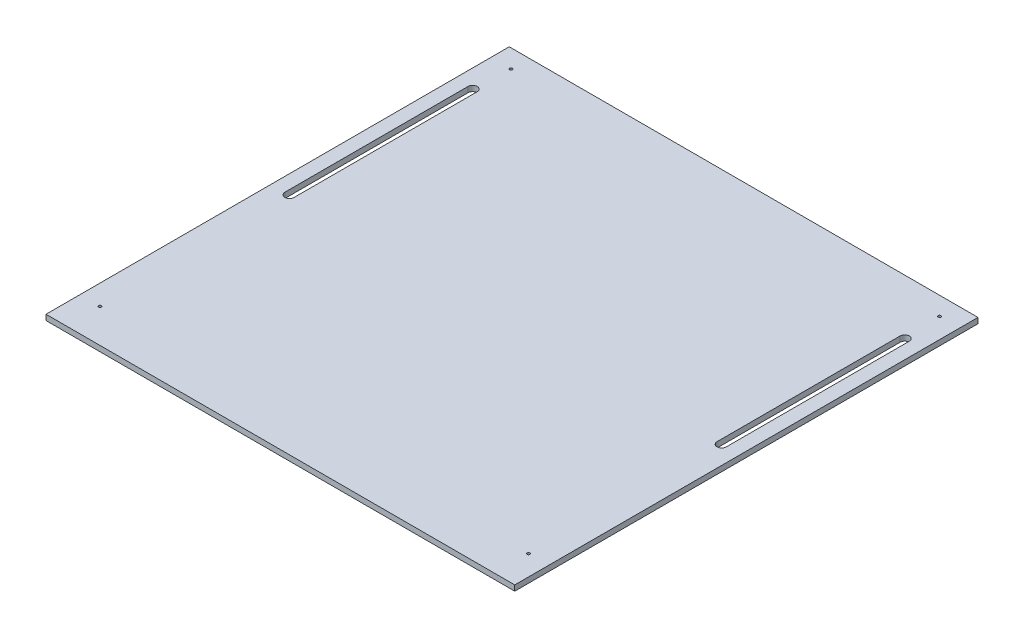
ISO-10303-21;
HEADER;
FILE_DESCRIPTION(('STEP AP214'),'2;1');
FILE_NAME('part.step','',(''),(''),'','','');
FILE_SCHEMA(('AUTOMOTIVE_DESIGN { 1 0 10303 214 1 1 1 1 }'));
ENDSEC;
DATA;
#1=APPLICATION_CONTEXT('core data for automotive mechanical design processes');
#2=APPLICATION_PROTOCOL_DEFINITION('international standard','automotive_design',2000,#1);
#3=PRODUCT_CONTEXT('',#1,'mechanical');
#4=PRODUCT('Part','Part','',(#3));
#5=PRODUCT_RELATED_PRODUCT_CATEGORY('part','',(#4));
#6=PRODUCT_DEFINITION_FORMATION('','',#4);
#7=PRODUCT_DEFINITION_CONTEXT('part definition',#1,'design');
#8=PRODUCT_DEFINITION('design','',#6,#7);
#9=PRODUCT_DEFINITION_SHAPE('','',#8);
#10=(LENGTH_UNIT() NAMED_UNIT(*) SI_UNIT(.MILLI.,.METRE.));
#11=(NAMED_UNIT(*) PLANE_ANGLE_UNIT() SI_UNIT($,.RADIAN.));
#12=(NAMED_UNIT(*) SI_UNIT($,.STERADIAN.) SOLID_ANGLE_UNIT());
#13=UNCERTAINTY_MEASURE_WITH_UNIT(LENGTH_MEASURE(1.E-05),#10,'distance_accuracy_value','');
#14=(GEOMETRIC_REPRESENTATION_CONTEXT(3) GLOBAL_UNCERTAINTY_ASSIGNED_CONTEXT((#13)) GLOBAL_UNIT_ASSIGNED_CONTEXT((#10,
#11,#12)) REPRESENTATION_CONTEXT('',''));
#15=CARTESIAN_POINT('',(0.,0.,0.));
#16=DIRECTION('',(0.,0.,1.));
#17=DIRECTION('',(1.,0.,0.));
#18=AXIS2_PLACEMENT_3D('',#15,#16,#17);
#19=CARTESIAN_POINT('',(0.,6.,0.));
#20=DIRECTION('',(0.,1.,0.));
#21=DIRECTION('',(0.,0.,1.));
#22=AXIS2_PLACEMENT_3D('',#19,#20,#21);
#23=PLANE('',#22);
#24=CARTESIAN_POINT('',(14.,6.,60.));
#25=DIRECTION('',(0.,-1.,0.));
#26=DIRECTION('',(0.,0.,-1.));
#27=AXIS2_PLACEMENT_3D('',#24,#25,#26);
#28=CIRCLE('',#27,5.);
#29=CARTESIAN_POINT('',(9.,6.,59.9999999999999));
#30=VERTEX_POINT('',#29);
#31=CARTESIAN_POINT('',(19.,6.,59.9999999999999));
#32=VERTEX_POINT('',#31);
#33=EDGE_CURVE('E134',#30,#32,#28,.T.);
#34=ORIENTED_EDGE('',*,*,#33,.T.);
#35=DIRECTION('',(0.,0.,1.));
#36=VECTOR('',#35,1.);
#37=CARTESIAN_POINT('',(19.,6.,59.9999999999999));
#38=LINE('',#37,#36);
#39=CARTESIAN_POINT('',(19.,6.,260.));
#40=VERTEX_POINT('',#39);
#41=EDGE_CURVE('E146',#32,#40,#38,.T.);
#42=ORIENTED_EDGE('',*,*,#41,.T.);
#43=CARTESIAN_POINT('',(13.9999999999993,6.,260.));
#44=DIRECTION('',(0.,-1.,0.));
#45=DIRECTION('',(0.,0.,-1.));
#46=AXIS2_PLACEMENT_3D('',#43,#44,#45);
#47=CIRCLE('',#46,5.);
#48=CARTESIAN_POINT('',(9.,6.,260.));
#49=VERTEX_POINT('',#48);
#50=EDGE_CURVE('E55',#40,#49,#47,.T.);
#51=ORIENTED_EDGE('',*,*,#50,.T.);
#52=DIRECTION('',(0.,0.,1.));
#53=VECTOR('',#52,1.);
#54=CARTESIAN_POINT('',(9.,6.,59.9999999999999));
#55=LINE('',#54,#53);
#56=EDGE_CURVE('E143',#30,#49,#55,.T.);
#57=ORIENTED_EDGE('',*,*,#56,.F.);
#58=EDGE_LOOP('',(#34,#42,#51,#57));
#59=FACE_BOUND('',#58,.T.);
#60=CARTESIAN_POINT('',(16.0000000000001,6.,469.));
#61=DIRECTION('',(0.,1.,0.));
#62=DIRECTION('',(0.,0.,1.));
#63=AXIS2_PLACEMENT_3D('',#60,#61,#62);
#64=CIRCLE('',#63,1.5);
#65=CARTESIAN_POINT('',(16.0000000000001,6.,470.5));
#66=VERTEX_POINT('',#65);
#67=EDGE_CURVE('E268',#66,#66,#64,.T.);
#68=ORIENTED_EDGE('',*,*,#67,.F.);
#69=EDGE_LOOP('',(#68));
#70=FACE_BOUND('',#69,.T.);
#71=CARTESIAN_POINT('',(484.,6.,20.));
#72=DIRECTION('',(0.,1.,0.));
#73=DIRECTION('',(0.,0.,1.));
#74=AXIS2_PLACEMENT_3D('',#71,#72,#73);
#75=CIRCLE('',#74,1.52499999999982);
#76=CARTESIAN_POINT('',(484.,6.,21.5249999999998));
#77=VERTEX_POINT('',#76);
#78=EDGE_CURVE('E284',#77,#77,#75,.T.);
#79=ORIENTED_EDGE('',*,*,#78,.F.);
#80=EDGE_LOOP('',(#79));
#81=FACE_BOUND('',#80,.T.);
#82=DIRECTION('',(-1.,0.,0.));
#83=VECTOR('',#82,1.);
#84=CARTESIAN_POINT('',(0.,6.,0.));
#85=LINE('',#84,#83);
#86=CARTESIAN_POINT('',(506.,6.,0.));
#87=VERTEX_POINT('',#86);
#88=CARTESIAN_POINT('',(-5.99999999999994,6.,-1.11022302462516E-13));
#89=VERTEX_POINT('',#88);
#90=EDGE_CURVE('E11',#87,#89,#85,.T.);
#91=ORIENTED_EDGE('',*,*,#90,.T.);
#92=DIRECTION('',(0.,0.,-1.));
#93=VECTOR('',#92,1.);
#94=CARTESIAN_POINT('',(-6.,6.,506.));
#95=LINE('',#94,#93);
#96=CARTESIAN_POINT('',(-6.,6.,506.));
#97=VERTEX_POINT('',#96);
#98=EDGE_CURVE('E222',#97,#89,#95,.T.);
#99=ORIENTED_EDGE('',*,*,#98,.F.);
#100=DIRECTION('',(-1.,0.,0.));
#101=VECTOR('',#100,1.);
#102=CARTESIAN_POINT('',(506.,6.,506.));
#103=LINE('',#102,#101);
#104=CARTESIAN_POINT('',(506.,6.,506.));
#105=VERTEX_POINT('',#104);
#106=EDGE_CURVE('E226',#105,#97,#103,.T.);
#107=ORIENTED_EDGE('',*,*,#106,.F.);
#108=DIRECTION('',(0.,0.,1.));
#109=VECTOR('',#108,1.);
#110=CARTESIAN_POINT('',(506.,6.,0.));
#111=LINE('',#110,#109);
#112=EDGE_CURVE('E231',#87,#105,#111,.T.);
#113=ORIENTED_EDGE('',*,*,#112,.F.);
#114=EDGE_LOOP('',(#91,#99,#107,#113));
#115=FACE_BOUND('',#114,.T.);
#116=CARTESIAN_POINT('',(16.,6.,19.9999999999999));
#117=DIRECTION('',(0.,1.,0.));
#118=DIRECTION('',(0.,0.,1.));
#119=AXIS2_PLACEMENT_3D('',#116,#117,#118);
#120=CIRCLE('',#119,1.50000000000016);
#121=CARTESIAN_POINT('',(16.,6.,21.5000000000001));
#122=VERTEX_POINT('',#121);
#123=EDGE_CURVE('E276',#122,#122,#120,.T.);
#124=ORIENTED_EDGE('',*,*,#123,.F.);
#125=EDGE_LOOP('',(#124));
#126=FACE_BOUND('',#125,.T.);
#127=CARTESIAN_POINT('',(484.,6.,469.));
#128=DIRECTION('',(0.,1.,0.));
#129=DIRECTION('',(0.,0.,1.));
#130=AXIS2_PLACEMENT_3D('',#127,#128,#129);
#131=CIRCLE('',#130,1.50000000000002);
#132=CARTESIAN_POINT('',(484.,6.,470.5));
#133=VERTEX_POINT('',#132);
#134=EDGE_CURVE('E260',#133,#133,#131,.T.);
#135=ORIENTED_EDGE('',*,*,#134,.F.);
#136=EDGE_LOOP('',(#135));
#137=FACE_BOUND('',#136,.T.);
#138=DIRECTION('',(0.,0.,1.));
#139=VECTOR('',#138,1.);
#140=CARTESIAN_POINT('',(481.,6.,59.9999999999999));
#141=LINE('',#140,#139);
#142=CARTESIAN_POINT('',(481.,6.,59.9999999999999));
#143=VERTEX_POINT('',#142);
#144=CARTESIAN_POINT('',(481.,6.,260.));
#145=VERTEX_POINT('',#144);
#146=EDGE_CURVE('E217',#143,#145,#141,.T.);
#147=ORIENTED_EDGE('',*,*,#146,.F.);
#148=CARTESIAN_POINT('',(486.,6.,60.));
#149=DIRECTION('',(0.,1.,0.));
#150=DIRECTION('',(0.,0.,1.));
#151=AXIS2_PLACEMENT_3D('',#148,#149,#150);
#152=CIRCLE('',#151,4.99999999999998);
#153=CARTESIAN_POINT('',(491.,6.,59.9999999999999));
#154=VERTEX_POINT('',#153);
#155=EDGE_CURVE('E200',#154,#143,#152,.T.);
#156=ORIENTED_EDGE('',*,*,#155,.F.);
#157=DIRECTION('',(0.,0.,1.));
#158=VECTOR('',#157,1.);
#159=CARTESIAN_POINT('',(491.,6.,59.9999999999999));
#160=LINE('',#159,#158);
#161=CARTESIAN_POINT('',(491.,6.,260.));
#162=VERTEX_POINT('',#161);
#163=EDGE_CURVE('E195',#154,#162,#160,.T.);
#164=ORIENTED_EDGE('',*,*,#163,.T.);
#165=CARTESIAN_POINT('',(486.000000000001,6.,260.));
#166=DIRECTION('',(0.,1.,0.));
#167=DIRECTION('',(0.,0.,1.));
#168=AXIS2_PLACEMENT_3D('',#165,#166,#167);
#169=CIRCLE('',#168,4.99999999999998);
#170=EDGE_CURVE('E214',#145,#162,#169,.T.);
#171=ORIENTED_EDGE('',*,*,#170,.F.);
#172=EDGE_LOOP('',(#147,#156,#164,#171));
#173=FACE_BOUND('',#172,.T.);
#174=ADVANCED_FACE('F39',(#59,#70,#81,#115,#126,#137,#173),#23,.T.);
#175=CARTESIAN_POINT('',(0.,0.,0.));
#176=DIRECTION('',(0.,1.,0.));
#177=DIRECTION('',(0.,0.,1.));
#178=AXIS2_PLACEMENT_3D('',#175,#176,#177);
#179=PLANE('',#178);
#180=DIRECTION('',(0.,0.,1.));
#181=VECTOR('',#180,1.);
#182=CARTESIAN_POINT('',(19.,0.,59.9999999999999));
#183=LINE('',#182,#181);
#184=CARTESIAN_POINT('',(19.,0.,59.9999999999999));
#185=VERTEX_POINT('',#184);
#186=CARTESIAN_POINT('',(18.9999999999993,0.,260.));
#187=VERTEX_POINT('',#186);
#188=EDGE_CURVE('E166',#185,#187,#183,.T.);
#189=ORIENTED_EDGE('',*,*,#188,.F.);
#190=CARTESIAN_POINT('',(14.,0.,60.));
#191=DIRECTION('',(0.,-1.,0.));
#192=DIRECTION('',(0.,0.,-1.));
#193=AXIS2_PLACEMENT_3D('',#190,#191,#192);
#194=CIRCLE('',#193,5.);
#195=CARTESIAN_POINT('',(9.,0.,59.9999999999999));
#196=VERTEX_POINT('',#195);
#197=EDGE_CURVE('E137',#196,#185,#194,.T.);
#198=ORIENTED_EDGE('',*,*,#197,.F.);
#199=DIRECTION('',(0.,0.,1.));
#200=VECTOR('',#199,1.);
#201=CARTESIAN_POINT('',(9.,0.,59.9999999999999));
#202=LINE('',#201,#200);
#203=CARTESIAN_POINT('',(9.,0.,260.));
#204=VERTEX_POINT('',#203);
#205=EDGE_CURVE('E153',#196,#204,#202,.T.);
#206=ORIENTED_EDGE('',*,*,#205,.T.);
#207=CARTESIAN_POINT('',(13.9999999999993,0.,260.));
#208=DIRECTION('',(0.,-1.,0.));
#209=DIRECTION('',(0.,0.,-1.));
#210=AXIS2_PLACEMENT_3D('',#207,#208,#209);
#211=CIRCLE('',#210,5.);
#212=EDGE_CURVE('E157',#187,#204,#211,.T.);
#213=ORIENTED_EDGE('',*,*,#212,.F.);
#214=EDGE_LOOP('',(#189,#198,#206,#213));
#215=FACE_BOUND('',#214,.T.);
#216=CARTESIAN_POINT('',(484.,0.,469.));
#217=DIRECTION('',(0.,1.,0.));
#218=DIRECTION('',(0.,0.,1.));
#219=AXIS2_PLACEMENT_3D('',#216,#217,#218);
#220=CIRCLE('',#219,1.50000000000002);
#221=CARTESIAN_POINT('',(484.,0.,470.5));
#222=VERTEX_POINT('',#221);
#223=EDGE_CURVE('E259',#222,#222,#220,.T.);
#224=ORIENTED_EDGE('',*,*,#223,.T.);
#225=EDGE_LOOP('',(#224));
#226=FACE_BOUND('',#225,.T.);
#227=CARTESIAN_POINT('',(16.0000000000001,0.,469.));
#228=DIRECTION('',(0.,1.,0.));
#229=DIRECTION('',(0.,0.,1.));
#230=AXIS2_PLACEMENT_3D('',#227,#228,#229);
#231=CIRCLE('',#230,1.5);
#232=CARTESIAN_POINT('',(16.0000000000001,0.,470.5));
#233=VERTEX_POINT('',#232);
#234=EDGE_CURVE('E264',#233,#233,#231,.T.);
#235=ORIENTED_EDGE('',*,*,#234,.T.);
#236=EDGE_LOOP('',(#235));
#237=FACE_BOUND('',#236,.T.);
#238=CARTESIAN_POINT('',(16.,0.,19.9999999999999));
#239=DIRECTION('',(0.,1.,0.));
#240=DIRECTION('',(0.,0.,1.));
#241=AXIS2_PLACEMENT_3D('',#238,#239,#240);
#242=CIRCLE('',#241,1.50000000000016);
#243=CARTESIAN_POINT('',(16.,0.,21.5000000000001));
#244=VERTEX_POINT('',#243);
#245=EDGE_CURVE('E272',#244,#244,#242,.T.);
#246=ORIENTED_EDGE('',*,*,#245,.T.);
#247=EDGE_LOOP('',(#246));
#248=FACE_BOUND('',#247,.T.);
#249=CARTESIAN_POINT('',(484.,0.,20.));
#250=DIRECTION('',(0.,1.,0.));
#251=DIRECTION('',(0.,0.,1.));
#252=AXIS2_PLACEMENT_3D('',#249,#250,#251);
#253=CIRCLE('',#252,1.52499999999982);
#254=CARTESIAN_POINT('',(484.,0.,21.5249999999998));
#255=VERTEX_POINT('',#254);
#256=EDGE_CURVE('E280',#255,#255,#253,.T.);
#257=ORIENTED_EDGE('',*,*,#256,.T.);
#258=EDGE_LOOP('',(#257));
#259=FACE_BOUND('',#258,.T.);
#260=DIRECTION('',(0.,0.,-1.));
#261=VECTOR('',#260,1.);
#262=CARTESIAN_POINT('',(-6.,0.,506.));
#263=LINE('',#262,#261);
#264=CARTESIAN_POINT('',(-6.,0.,506.));
#265=VERTEX_POINT('',#264);
#266=CARTESIAN_POINT('',(-5.99999999999994,0.,-1.11022302462516E-13));
#267=VERTEX_POINT('',#266);
#268=EDGE_CURVE('E176',#265,#267,#263,.T.);
#269=ORIENTED_EDGE('',*,*,#268,.T.);
#270=DIRECTION('',(-1.,0.,0.));
#271=VECTOR('',#270,1.);
#272=CARTESIAN_POINT('',(0.,0.,0.));
#273=LINE('',#272,#271);
#274=CARTESIAN_POINT('',(506.,0.,0.));
#275=VERTEX_POINT('',#274);
#276=EDGE_CURVE('E43',#275,#267,#273,.T.);
#277=ORIENTED_EDGE('',*,*,#276,.F.);
#278=DIRECTION('',(0.,0.,1.));
#279=VECTOR('',#278,1.);
#280=CARTESIAN_POINT('',(506.,0.,0.));
#281=LINE('',#280,#279);
#282=CARTESIAN_POINT('',(506.,0.,506.));
#283=VERTEX_POINT('',#282);
#284=EDGE_CURVE('E227',#275,#283,#281,.T.);
#285=ORIENTED_EDGE('',*,*,#284,.T.);
#286=DIRECTION('',(-1.,0.,0.));
#287=VECTOR('',#286,1.);
#288=CARTESIAN_POINT('',(506.,0.,506.));
#289=LINE('',#288,#287);
#290=EDGE_CURVE('E239',#283,#265,#289,.T.);
#291=ORIENTED_EDGE('',*,*,#290,.T.);
#292=EDGE_LOOP('',(#269,#277,#285,#291));
#293=FACE_BOUND('',#292,.T.);
#294=CARTESIAN_POINT('',(486.,0.,60.));
#295=DIRECTION('',(0.,1.,0.));
#296=DIRECTION('',(0.,0.,1.));
#297=AXIS2_PLACEMENT_3D('',#294,#295,#296);
#298=CIRCLE('',#297,4.99999999999998);
#299=CARTESIAN_POINT('',(491.,0.,59.9999999999999));
#300=VERTEX_POINT('',#299);
#301=CARTESIAN_POINT('',(481.,0.,59.9999999999999));
#302=VERTEX_POINT('',#301);
#303=EDGE_CURVE('E167',#300,#302,#298,.T.);
#304=ORIENTED_EDGE('',*,*,#303,.T.);
#305=DIRECTION('',(0.,0.,1.));
#306=VECTOR('',#305,1.);
#307=CARTESIAN_POINT('',(481.,0.,59.9999999999999));
#308=LINE('',#307,#306);
#309=CARTESIAN_POINT('',(481.,0.,260.));
#310=VERTEX_POINT('',#309);
#311=EDGE_CURVE('E204',#302,#310,#308,.T.);
#312=ORIENTED_EDGE('',*,*,#311,.T.);
#313=CARTESIAN_POINT('',(486.000000000001,0.,260.));
#314=DIRECTION('',(0.,1.,0.));
#315=DIRECTION('',(0.,0.,1.));
#316=AXIS2_PLACEMENT_3D('',#313,#314,#315);
#317=CIRCLE('',#316,4.99999999999998);
#318=CARTESIAN_POINT('',(491.000000000001,0.,260.));
#319=VERTEX_POINT('',#318);
#320=EDGE_CURVE('E199',#310,#319,#317,.T.);
#321=ORIENTED_EDGE('',*,*,#320,.T.);
#322=DIRECTION('',(0.,0.,1.));
#323=VECTOR('',#322,1.);
#324=CARTESIAN_POINT('',(491.,0.,59.9999999999999));
#325=LINE('',#324,#323);
#326=EDGE_CURVE('E196',#300,#319,#325,.T.);
#327=ORIENTED_EDGE('',*,*,#326,.F.);
#328=EDGE_LOOP('',(#304,#312,#321,#327));
#329=FACE_BOUND('',#328,.T.);
#330=ADVANCED_FACE('F292',(#215,#226,#237,#248,#259,#293,#329),#179,.F.);
#331=CARTESIAN_POINT('',(0.,6.,0.));
#332=DIRECTION('',(0.,0.,1.));
#333=DIRECTION('',(1.,0.,0.));
#334=AXIS2_PLACEMENT_3D('',#331,#332,#333);
#335=PLANE('',#334);
#336=ORIENTED_EDGE('',*,*,#276,.T.);
#337=DIRECTION('',(0.,-1.,0.));
#338=VECTOR('',#337,1.);
#339=CARTESIAN_POINT('',(-5.99999999999994,6.,-1.11022302462516E-13));
#340=LINE('',#339,#338);
#341=EDGE_CURVE('E255',#89,#267,#340,.T.);
#342=ORIENTED_EDGE('',*,*,#341,.F.);
#343=ORIENTED_EDGE('',*,*,#90,.F.);
#344=DIRECTION('',(0.,-1.,0.));
#345=VECTOR('',#344,1.);
#346=CARTESIAN_POINT('',(506.,6.,0.));
#347=LINE('',#346,#345);
#348=EDGE_CURVE('E235',#87,#275,#347,.T.);
#349=ORIENTED_EDGE('',*,*,#348,.T.);
#350=EDGE_LOOP('',(#336,#342,#343,#349));
#351=FACE_BOUND('',#350,.T.);
#352=ADVANCED_FACE('F41',(#351),#335,.F.);
#353=CARTESIAN_POINT('',(484.,6.,20.));
#354=DIRECTION('',(0.,-1.,0.));
#355=DIRECTION('',(0.,0.,-1.));
#356=AXIS2_PLACEMENT_3D('',#353,#354,#355);
#357=CYLINDRICAL_SURFACE('',#356,1.52499999999982);
#358=ORIENTED_EDGE('',*,*,#78,.T.);
#359=EDGE_LOOP('',(#358));
#360=FACE_BOUND('',#359,.T.);
#361=ORIENTED_EDGE('',*,*,#256,.F.);
#362=EDGE_LOOP('',(#361));
#363=FACE_BOUND('',#362,.T.);
#364=ADVANCED_FACE('F295',(#360,#363),#357,.F.);
#365=CARTESIAN_POINT('',(16.,6.,19.9999999999999));
#366=DIRECTION('',(0.,-1.,0.));
#367=DIRECTION('',(0.,0.,-1.));
#368=AXIS2_PLACEMENT_3D('',#365,#366,#367);
#369=CYLINDRICAL_SURFACE('',#368,1.50000000000016);
#370=ORIENTED_EDGE('',*,*,#123,.T.);
#371=EDGE_LOOP('',(#370));
#372=FACE_BOUND('',#371,.T.);
#373=ORIENTED_EDGE('',*,*,#245,.F.);
#374=EDGE_LOOP('',(#373));
#375=FACE_BOUND('',#374,.T.);
#376=ADVANCED_FACE('F297',(#372,#375),#369,.F.);
#377=CARTESIAN_POINT('',(16.0000000000001,6.,469.));
#378=DIRECTION('',(0.,-1.,0.));
#379=DIRECTION('',(0.,0.,-1.));
#380=AXIS2_PLACEMENT_3D('',#377,#378,#379);
#381=CYLINDRICAL_SURFACE('',#380,1.5);
#382=ORIENTED_EDGE('',*,*,#67,.T.);
#383=EDGE_LOOP('',(#382));
#384=FACE_BOUND('',#383,.T.);
#385=ORIENTED_EDGE('',*,*,#234,.F.);
#386=EDGE_LOOP('',(#385));
#387=FACE_BOUND('',#386,.T.);
#388=ADVANCED_FACE('F304',(#384,#387),#381,.F.);
#389=CARTESIAN_POINT('',(484.,6.,469.));
#390=DIRECTION('',(0.,-1.,0.));
#391=DIRECTION('',(0.,0.,-1.));
#392=AXIS2_PLACEMENT_3D('',#389,#390,#391);
#393=CYLINDRICAL_SURFACE('',#392,1.50000000000002);
#394=ORIENTED_EDGE('',*,*,#134,.T.);
#395=EDGE_LOOP('',(#394));
#396=FACE_BOUND('',#395,.T.);
#397=ORIENTED_EDGE('',*,*,#223,.F.);
#398=EDGE_LOOP('',(#397));
#399=FACE_BOUND('',#398,.T.);
#400=ADVANCED_FACE('F326',(#396,#399),#393,.F.);
#401=CARTESIAN_POINT('',(-6.,6.,506.));
#402=DIRECTION('',(-1.,0.,0.));
#403=DIRECTION('',(0.,0.,1.));
#404=AXIS2_PLACEMENT_3D('',#401,#402,#403);
#405=PLANE('',#404);
#406=ORIENTED_EDGE('',*,*,#268,.F.);
#407=DIRECTION('',(0.,-1.,0.));
#408=VECTOR('',#407,1.);
#409=CARTESIAN_POINT('',(-6.,6.,506.));
#410=LINE('',#409,#408);
#411=EDGE_CURVE('E252',#97,#265,#410,.T.);
#412=ORIENTED_EDGE('',*,*,#411,.F.);
#413=ORIENTED_EDGE('',*,*,#98,.T.);
#414=ORIENTED_EDGE('',*,*,#341,.T.);
#415=EDGE_LOOP('',(#406,#412,#413,#414));
#416=FACE_BOUND('',#415,.T.);
#417=ADVANCED_FACE('F332',(#416),#405,.T.);
#418=CARTESIAN_POINT('',(506.,6.,506.));
#419=DIRECTION('',(0.,0.,1.));
#420=DIRECTION('',(1.,0.,0.));
#421=AXIS2_PLACEMENT_3D('',#418,#419,#420);
#422=PLANE('',#421);
#423=ORIENTED_EDGE('',*,*,#290,.F.);
#424=DIRECTION('',(0.,-1.,0.));
#425=VECTOR('',#424,1.);
#426=CARTESIAN_POINT('',(506.,6.,506.));
#427=LINE('',#426,#425);
#428=EDGE_CURVE('E249',#105,#283,#427,.T.);
#429=ORIENTED_EDGE('',*,*,#428,.F.);
#430=ORIENTED_EDGE('',*,*,#106,.T.);
#431=ORIENTED_EDGE('',*,*,#411,.T.);
#432=EDGE_LOOP('',(#423,#429,#430,#431));
#433=FACE_BOUND('',#432,.T.);
#434=ADVANCED_FACE('F338',(#433),#422,.T.);
#435=CARTESIAN_POINT('',(506.,6.,0.));
#436=DIRECTION('',(1.,0.,0.));
#437=DIRECTION('',(0.,0.,-1.));
#438=AXIS2_PLACEMENT_3D('',#435,#436,#437);
#439=PLANE('',#438);
#440=ORIENTED_EDGE('',*,*,#284,.F.);
#441=ORIENTED_EDGE('',*,*,#348,.F.);
#442=ORIENTED_EDGE('',*,*,#112,.T.);
#443=ORIENTED_EDGE('',*,*,#428,.T.);
#444=EDGE_LOOP('',(#440,#441,#442,#443));
#445=FACE_BOUND('',#444,.T.);
#446=ADVANCED_FACE('F342',(#445),#439,.T.);
#447=CARTESIAN_POINT('',(486.,6.,60.));
#448=DIRECTION('',(0.,-1.,0.));
#449=DIRECTION('',(0.,0.,-1.));
#450=AXIS2_PLACEMENT_3D('',#447,#448,#449);
#451=CYLINDRICAL_SURFACE('',#450,4.99999999999998);
#452=ORIENTED_EDGE('',*,*,#303,.F.);
#453=DIRECTION('',(0.,-1.,0.));
#454=VECTOR('',#453,1.);
#455=CARTESIAN_POINT('',(491.,6.,59.9999999999999));
#456=LINE('',#455,#454);
#457=EDGE_CURVE('E191',#154,#300,#456,.T.);
#458=ORIENTED_EDGE('',*,*,#457,.F.);
#459=ORIENTED_EDGE('',*,*,#155,.T.);
#460=DIRECTION('',(0.,-1.,0.));
#461=VECTOR('',#460,1.);
#462=CARTESIAN_POINT('',(481.,6.,59.9999999999999));
#463=LINE('',#462,#461);
#464=EDGE_CURVE('E182',#143,#302,#463,.T.);
#465=ORIENTED_EDGE('',*,*,#464,.T.);
#466=EDGE_LOOP('',(#452,#458,#459,#465));
#467=FACE_BOUND('',#466,.T.);
#468=ADVANCED_FACE('F346',(#467),#451,.F.);
#469=CARTESIAN_POINT('',(481.,6.,59.9999999999999));
#470=DIRECTION('',(1.,0.,0.));
#471=DIRECTION('',(0.,0.,-1.));
#472=AXIS2_PLACEMENT_3D('',#469,#470,#471);
#473=PLANE('',#472);
#474=ORIENTED_EDGE('',*,*,#311,.F.);
#475=ORIENTED_EDGE('',*,*,#464,.F.);
#476=ORIENTED_EDGE('',*,*,#146,.T.);
#477=DIRECTION('',(0.,-1.,0.));
#478=VECTOR('',#477,1.);
#479=CARTESIAN_POINT('',(481.,6.,260.));
#480=LINE('',#479,#478);
#481=EDGE_CURVE('E186',#145,#310,#480,.T.);
#482=ORIENTED_EDGE('',*,*,#481,.T.);
#483=EDGE_LOOP('',(#474,#475,#476,#482));
#484=FACE_BOUND('',#483,.T.);
#485=ADVANCED_FACE('F354',(#484),#473,.T.);
#486=CARTESIAN_POINT('',(486.000000000001,6.,260.));
#487=DIRECTION('',(0.,-1.,0.));
#488=DIRECTION('',(0.,0.,-1.));
#489=AXIS2_PLACEMENT_3D('',#486,#487,#488);
#490=CYLINDRICAL_SURFACE('',#489,4.99999999999998);
#491=ORIENTED_EDGE('',*,*,#320,.F.);
#492=ORIENTED_EDGE('',*,*,#481,.F.);
#493=ORIENTED_EDGE('',*,*,#170,.T.);
#494=DIRECTION('',(0.,-1.,0.));
#495=VECTOR('',#494,1.);
#496=CARTESIAN_POINT('',(491.000000000001,6.,260.));
#497=LINE('',#496,#495);
#498=EDGE_CURVE('E63',#162,#319,#497,.T.);
#499=ORIENTED_EDGE('',*,*,#498,.T.);
#500=EDGE_LOOP('',(#491,#492,#493,#499));
#501=FACE_BOUND('',#500,.T.);
#502=ADVANCED_FACE('F351',(#501),#490,.F.);
#503=CARTESIAN_POINT('',(491.,6.,59.9999999999999));
#504=DIRECTION('',(1.,0.,0.));
#505=DIRECTION('',(0.,0.,-1.));
#506=AXIS2_PLACEMENT_3D('',#503,#504,#505);
#507=PLANE('',#506);
#508=ORIENTED_EDGE('',*,*,#326,.T.);
#509=ORIENTED_EDGE('',*,*,#498,.F.);
#510=ORIENTED_EDGE('',*,*,#163,.F.);
#511=ORIENTED_EDGE('',*,*,#457,.T.);
#512=EDGE_LOOP('',(#508,#509,#510,#511));
#513=FACE_BOUND('',#512,.T.);
#514=ADVANCED_FACE('F348',(#513),#507,.F.);
#515=CARTESIAN_POINT('',(14.,6.,60.));
#516=DIRECTION('',(0.,-1.,0.));
#517=DIRECTION('',(0.,0.,-1.));
#518=AXIS2_PLACEMENT_3D('',#515,#516,#517);
#519=CYLINDRICAL_SURFACE('',#518,5.);
#520=ORIENTED_EDGE('',*,*,#197,.T.);
#521=DIRECTION('',(0.,-1.,0.));
#522=VECTOR('',#521,1.);
#523=CARTESIAN_POINT('',(19.,6.,59.9999999999999));
#524=LINE('',#523,#522);
#525=EDGE_CURVE('E130',#32,#185,#524,.T.);
#526=ORIENTED_EDGE('',*,*,#525,.F.);
#527=ORIENTED_EDGE('',*,*,#33,.F.);
#528=DIRECTION('',(0.,-1.,0.));
#529=VECTOR('',#528,1.);
#530=CARTESIAN_POINT('',(9.,6.,59.9999999999999));
#531=LINE('',#530,#529);
#532=EDGE_CURVE('E173',#30,#196,#531,.T.);
#533=ORIENTED_EDGE('',*,*,#532,.T.);
#534=EDGE_LOOP('',(#520,#526,#527,#533));
#535=FACE_BOUND('',#534,.T.);
#536=ADVANCED_FACE('F132',(#535),#519,.F.);
#537=CARTESIAN_POINT('',(9.,6.,59.9999999999999));
#538=DIRECTION('',(1.,0.,0.));
#539=DIRECTION('',(0.,0.,-1.));
#540=AXIS2_PLACEMENT_3D('',#537,#538,#539);
#541=PLANE('',#540);
#542=ORIENTED_EDGE('',*,*,#205,.F.);
#543=ORIENTED_EDGE('',*,*,#532,.F.);
#544=ORIENTED_EDGE('',*,*,#56,.T.);
#545=DIRECTION('',(0.,-1.,0.));
#546=VECTOR('',#545,1.);
#547=CARTESIAN_POINT('',(9.,6.,260.));
#548=LINE('',#547,#546);
#549=EDGE_CURVE('E177',#49,#204,#548,.T.);
#550=ORIENTED_EDGE('',*,*,#549,.T.);
#551=EDGE_LOOP('',(#542,#543,#544,#550));
#552=FACE_BOUND('',#551,.T.);
#553=ADVANCED_FACE('F364',(#552),#541,.T.);
#554=CARTESIAN_POINT('',(13.9999999999993,6.,260.));
#555=DIRECTION('',(0.,-1.,0.));
#556=DIRECTION('',(0.,0.,-1.));
#557=AXIS2_PLACEMENT_3D('',#554,#555,#556);
#558=CYLINDRICAL_SURFACE('',#557,5.);
#559=ORIENTED_EDGE('',*,*,#212,.T.);
#560=ORIENTED_EDGE('',*,*,#549,.F.);
#561=ORIENTED_EDGE('',*,*,#50,.F.);
#562=DIRECTION('',(0.,-1.,0.));
#563=VECTOR('',#562,1.);
#564=CARTESIAN_POINT('',(18.9999999999993,6.,260.));
#565=LINE('',#564,#563);
#566=EDGE_CURVE('E142',#40,#187,#565,.T.);
#567=ORIENTED_EDGE('',*,*,#566,.T.);
#568=EDGE_LOOP('',(#559,#560,#561,#567));
#569=FACE_BOUND('',#568,.T.);
#570=ADVANCED_FACE('F367',(#569),#558,.F.);
#571=CARTESIAN_POINT('',(19.,6.,59.9999999999999));
#572=DIRECTION('',(1.,0.,0.));
#573=DIRECTION('',(0.,0.,-1.));
#574=AXIS2_PLACEMENT_3D('',#571,#572,#573);
#575=PLANE('',#574);
#576=ORIENTED_EDGE('',*,*,#188,.T.);
#577=ORIENTED_EDGE('',*,*,#566,.F.);
#578=ORIENTED_EDGE('',*,*,#41,.F.);
#579=ORIENTED_EDGE('',*,*,#525,.T.);
#580=EDGE_LOOP('',(#576,#577,#578,#579));
#581=FACE_BOUND('',#580,.T.);
#582=ADVANCED_FACE('F147',(#581),#575,.F.);
#583=CLOSED_SHELL('',(#174,#330,#352,#364,#376,#388,#400,#417,#434,#446,#468,#485,#502,#514,
#536,#553,#570,#582));
#584=MANIFOLD_SOLID_BREP('B2',#583);
#585=ADVANCED_BREP_SHAPE_REPRESENTATION('',(#18,#584),#14);
#586=SHAPE_DEFINITION_REPRESENTATION(#9,#585);
ENDSEC;
END-ISO-10303-21;
